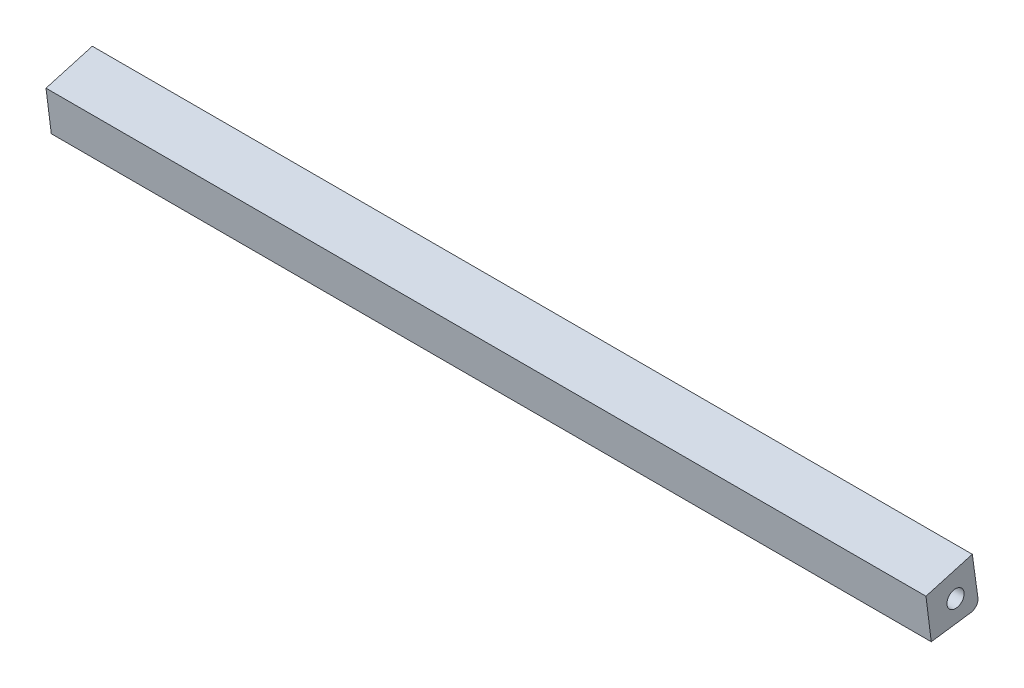
ISO-10303-21;
HEADER;
FILE_DESCRIPTION(('STEP AP214'),'2;1');
FILE_NAME('part.step','',(''),(''),'','','');
FILE_SCHEMA(('AUTOMOTIVE_DESIGN { 1 0 10303 214 1 1 1 1 }'));
ENDSEC;
DATA;
#1=APPLICATION_CONTEXT('core data for automotive mechanical design processes');
#2=APPLICATION_PROTOCOL_DEFINITION('international standard','automotive_design',2000,#1);
#3=PRODUCT_CONTEXT('',#1,'mechanical');
#4=PRODUCT('Part','Part','',(#3));
#5=PRODUCT_RELATED_PRODUCT_CATEGORY('part','',(#4));
#6=PRODUCT_DEFINITION_FORMATION('','',#4);
#7=PRODUCT_DEFINITION_CONTEXT('part definition',#1,'design');
#8=PRODUCT_DEFINITION('design','',#6,#7);
#9=PRODUCT_DEFINITION_SHAPE('','',#8);
#10=(LENGTH_UNIT() NAMED_UNIT(*) SI_UNIT(.MILLI.,.METRE.));
#11=(NAMED_UNIT(*) PLANE_ANGLE_UNIT() SI_UNIT($,.RADIAN.));
#12=(NAMED_UNIT(*) SI_UNIT($,.STERADIAN.) SOLID_ANGLE_UNIT());
#13=UNCERTAINTY_MEASURE_WITH_UNIT(LENGTH_MEASURE(1.E-05),#10,'distance_accuracy_value','');
#14=(GEOMETRIC_REPRESENTATION_CONTEXT(3) GLOBAL_UNCERTAINTY_ASSIGNED_CONTEXT((#13)) GLOBAL_UNIT_ASSIGNED_CONTEXT((#10,
#11,#12)) REPRESENTATION_CONTEXT('',''));
#15=CARTESIAN_POINT('',(0.,0.,0.));
#16=DIRECTION('',(0.,0.,1.));
#17=DIRECTION('',(1.,0.,0.));
#18=AXIS2_PLACEMENT_3D('',#15,#16,#17);
#19=CARTESIAN_POINT('',(215.,14.6744413355915,-105.8501577562));
#20=DIRECTION('',(0.,-0.13732076782963,0.990526631001247));
#21=DIRECTION('',(0.,-0.990526631001247,-0.13732076782963));
#22=AXIS2_PLACEMENT_3D('',#19,#20,#21);
#23=PLANE('',#22);
#24=DIRECTION('',(0.,0.990526631001247,0.13732076782963));
#25=VECTOR('',#24,1.);
#26=CARTESIAN_POINT('',(215.,14.6744413355915,-105.8501577562));
#27=LINE('',#26,#25);
#28=CARTESIAN_POINT('',(215.,65.169668157186,-98.8497974409366));
#29=VERTEX_POINT('',#28);
#30=CARTESIAN_POINT('',(215.,75.0749344671986,-97.4765897626403));
#31=VERTEX_POINT('',#30);
#32=EDGE_CURVE('E81',#29,#31,#27,.T.);
#33=ORIENTED_EDGE('',*,*,#32,.F.);
#34=DIRECTION('',(-1.,0.,0.));
#35=VECTOR('',#34,1.);
#36=CARTESIAN_POINT('',(215.,65.169668157186,-98.8497974409366));
#37=LINE('',#36,#35);
#38=CARTESIAN_POINT('',(0.,65.169668157186,-98.8497974409366));
#39=VERTEX_POINT('',#38);
#40=EDGE_CURVE('E104',#29,#39,#37,.T.);
#41=ORIENTED_EDGE('',*,*,#40,.T.);
#42=DIRECTION('',(0.,0.990526631001247,0.13732076782963));
#43=VECTOR('',#42,1.);
#44=CARTESIAN_POINT('',(0.,14.6744413355915,-105.8501577562));
#45=LINE('',#44,#43);
#46=CARTESIAN_POINT('',(0.,75.0749344671986,-97.4765897626403));
#47=VERTEX_POINT('',#46);
#48=EDGE_CURVE('E102',#39,#47,#45,.T.);
#49=ORIENTED_EDGE('',*,*,#48,.T.);
#50=DIRECTION('',(-1.,0.,0.));
#51=VECTOR('',#50,1.);
#52=CARTESIAN_POINT('',(215.,75.0749344671986,-97.4765897626403));
#53=LINE('',#52,#51);
#54=EDGE_CURVE('E96',#31,#47,#53,.T.);
#55=ORIENTED_EDGE('',*,*,#54,.F.);
#56=EDGE_LOOP('',(#33,#41,#49,#55));
#57=FACE_BOUND('',#56,.T.);
#58=ADVANCED_FACE('F35',(#57),#23,.F.);
#59=CARTESIAN_POINT('',(215.,43.8662739166155,12.4534450859423));
#60=DIRECTION('',(0.,-0.961984714958347,-0.273103292156116));
#61=DIRECTION('',(0.,0.273103292156116,-0.961984714958347));
#62=AXIS2_PLACEMENT_3D('',#59,#60,#61);
#63=PLANE('',#62);
#64=DIRECTION('',(0.,-0.273103292156116,0.961984714958347));
#65=VECTOR('',#64,1.);
#66=CARTESIAN_POINT('',(0.,43.8662739166155,12.4534450859423));
#67=LINE('',#66,#65);
#68=CARTESIAN_POINT('',(0.,71.8610007067405,-86.1557626571146));
#69=VERTEX_POINT('',#68);
#70=EDGE_CURVE('E118',#47,#69,#67,.T.);
#71=ORIENTED_EDGE('',*,*,#70,.T.);
#72=DIRECTION('',(-1.,0.,0.));
#73=VECTOR('',#72,1.);
#74=CARTESIAN_POINT('',(215.,71.8610007067405,-86.1557626571146));
#75=LINE('',#74,#73);
#76=CARTESIAN_POINT('',(215.,71.8610007067405,-86.1557626571146));
#77=VERTEX_POINT('',#76);
#78=EDGE_CURVE('E98',#77,#69,#75,.T.);
#79=ORIENTED_EDGE('',*,*,#78,.F.);
#80=DIRECTION('',(0.,-0.273103292156116,0.961984714958347));
#81=VECTOR('',#80,1.);
#82=CARTESIAN_POINT('',(215.,43.8662739166155,12.4534450859423));
#83=LINE('',#82,#81);
#84=EDGE_CURVE('E84',#31,#77,#83,.T.);
#85=ORIENTED_EDGE('',*,*,#84,.F.);
#86=ORIENTED_EDGE('',*,*,#54,.T.);
#87=EDGE_LOOP('',(#71,#79,#85,#86));
#88=FACE_BOUND('',#87,.T.);
#89=ADVANCED_FACE('F95',(#88),#63,.F.);
#90=CARTESIAN_POINT('',(215.,11.7658973593614,-93.7017559090627));
#91=DIRECTION('',(0.,0.124589152908748,-0.992208417106749));
#92=DIRECTION('',(0.,0.992208417106749,0.124589152908748));
#93=AXIS2_PLACEMENT_3D('',#90,#91,#92);
#94=PLANE('',#93);
#95=DIRECTION('',(0.,-0.992208417106749,-0.124589152908748));
#96=VECTOR('',#95,1.);
#97=CARTESIAN_POINT('',(0.,11.7658973593614,-93.7017559090627));
#98=LINE('',#97,#96);
#99=CARTESIAN_POINT('',(0.,61.5698616637079,-87.4479954922042));
#100=VERTEX_POINT('',#99);
#101=EDGE_CURVE('E116',#69,#100,#98,.T.);
#102=ORIENTED_EDGE('',*,*,#101,.T.);
#103=DIRECTION('',(-1.,0.,0.));
#104=VECTOR('',#103,1.);
#105=CARTESIAN_POINT('',(215.,61.5698616637079,-87.4479954922042));
#106=LINE('',#105,#104);
#107=CARTESIAN_POINT('',(215.,61.5698616637079,-87.4479954922042));
#108=VERTEX_POINT('',#107);
#109=EDGE_CURVE('E107',#108,#100,#106,.T.);
#110=ORIENTED_EDGE('',*,*,#109,.F.);
#111=DIRECTION('',(0.,-0.992208417106749,-0.124589152908748));
#112=VECTOR('',#111,1.);
#113=CARTESIAN_POINT('',(215.,11.7658973593614,-93.7017559090627));
#114=LINE('',#113,#112);
#115=EDGE_CURVE('E100',#77,#108,#114,.T.);
#116=ORIENTED_EDGE('',*,*,#115,.F.);
#117=ORIENTED_EDGE('',*,*,#78,.T.);
#118=EDGE_LOOP('',(#102,#110,#116,#117));
#119=FACE_BOUND('',#118,.T.);
#120=ADVANCED_FACE('F148',(#119),#94,.F.);
#121=CARTESIAN_POINT('',(215.,67.7346295990356,-93.379181481238));
#122=DIRECTION('',(-1.,0.,0.));
#123=DIRECTION('',(0.,0.,1.));
#124=AXIS2_PLACEMENT_3D('',#121,#122,#123);
#125=CYLINDRICAL_SURFACE('',#124,2.1);
#126=CARTESIAN_POINT('',(215.,67.7346295990356,-93.379181481238));
#127=DIRECTION('',(1.,0.,0.));
#128=DIRECTION('',(0.,0.,-1.));
#129=AXIS2_PLACEMENT_3D('',#126,#127,#128);
#130=CIRCLE('',#129,2.1);
#131=CARTESIAN_POINT('',(215.,67.7346295990356,-95.479181481238));
#132=VERTEX_POINT('',#131);
#133=EDGE_CURVE('E91',#132,#132,#130,.T.);
#134=ORIENTED_EDGE('',*,*,#133,.T.);
#135=EDGE_LOOP('',(#134));
#136=FACE_BOUND('',#135,.T.);
#137=CARTESIAN_POINT('',(0.,67.7346295990356,-93.379181481238));
#138=DIRECTION('',(1.,0.,0.));
#139=DIRECTION('',(0.,0.,-1.));
#140=AXIS2_PLACEMENT_3D('',#137,#138,#139);
#141=CIRCLE('',#140,2.1);
#142=CARTESIAN_POINT('',(0.,67.7346295990356,-95.479181481238));
#143=VERTEX_POINT('',#142);
#144=EDGE_CURVE('E121',#143,#143,#141,.T.);
#145=ORIENTED_EDGE('',*,*,#144,.F.);
#146=EDGE_LOOP('',(#145));
#147=FACE_BOUND('',#146,.T.);
#148=ADVANCED_FACE('F129',(#136,#147),#125,.F.);
#149=CARTESIAN_POINT('',(215.,48.5141735595921,6.72571877960414));
#150=DIRECTION('',(0.,0.990526631001247,0.13732076782963));
#151=DIRECTION('',(0.,-0.13732076782963,0.990526631001247));
#152=AXIS2_PLACEMENT_3D('',#149,#150,#151);
#153=PLANE('',#152);
#154=DIRECTION('',(0.,0.13732076782963,-0.990526631001247));
#155=VECTOR('',#154,1.);
#156=CARTESIAN_POINT('',(0.,48.5141735595921,6.72571877960414));
#157=LINE('',#156,#155);
#158=CARTESIAN_POINT('',(0.,62.9139733595243,-97.1433857145934));
#159=VERTEX_POINT('',#158);
#160=EDGE_CURVE('E114',#100,#159,#157,.T.);
#161=ORIENTED_EDGE('',*,*,#160,.T.);
#162=DIRECTION('',(-1.,0.,0.));
#163=VECTOR('',#162,1.);
#164=CARTESIAN_POINT('',(215.,62.9139733595243,-97.1433857145934));
#165=LINE('',#164,#163);
#166=CARTESIAN_POINT('',(215.,62.9139733595243,-97.1433857145934));
#167=VERTEX_POINT('',#166);
#168=EDGE_CURVE('E43',#159,#167,#165,.F.);
#169=ORIENTED_EDGE('',*,*,#168,.T.);
#170=DIRECTION('',(0.,0.13732076782963,-0.990526631001247));
#171=VECTOR('',#170,1.);
#172=CARTESIAN_POINT('',(215.,48.5141735595921,6.72571877960414));
#173=LINE('',#172,#171);
#174=EDGE_CURVE('E113',#108,#167,#173,.T.);
#175=ORIENTED_EDGE('',*,*,#174,.F.);
#176=ORIENTED_EDGE('',*,*,#109,.T.);
#177=EDGE_LOOP('',(#161,#169,#175,#176));
#178=FACE_BOUND('',#177,.T.);
#179=ADVANCED_FACE('F134',(#178),#153,.F.);
#180=CARTESIAN_POINT('',(215.,0.,0.));
#181=DIRECTION('',(1.,0.,0.));
#182=DIRECTION('',(0.,0.,-1.));
#183=AXIS2_PLACEMENT_3D('',#180,#181,#182);
#184=PLANE('',#183);
#185=ORIENTED_EDGE('',*,*,#133,.F.);
#186=EDGE_LOOP('',(#185));
#187=FACE_BOUND('',#186,.T.);
#188=ORIENTED_EDGE('',*,*,#174,.T.);
#189=CARTESIAN_POINT('',(215.,64.8950266215268,-96.8687441789341));
#190=DIRECTION('',(1.,0.,0.));
#191=DIRECTION('',(0.,0.,-1.));
#192=AXIS2_PLACEMENT_3D('',#189,#190,#191);
#193=CIRCLE('',#192,2.);
#194=EDGE_CURVE('E11',#167,#29,#193,.T.);
#195=ORIENTED_EDGE('',*,*,#194,.T.);
#196=ORIENTED_EDGE('',*,*,#32,.T.);
#197=ORIENTED_EDGE('',*,*,#84,.T.);
#198=ORIENTED_EDGE('',*,*,#115,.T.);
#199=EDGE_LOOP('',(#188,#195,#196,#197,#198));
#200=FACE_BOUND('',#199,.T.);
#201=ADVANCED_FACE('F83',(#187,#200),#184,.T.);
#202=CARTESIAN_POINT('',(0.,0.,0.));
#203=DIRECTION('',(1.,0.,0.));
#204=DIRECTION('',(0.,0.,-1.));
#205=AXIS2_PLACEMENT_3D('',#202,#203,#204);
#206=PLANE('',#205);
#207=ORIENTED_EDGE('',*,*,#144,.T.);
#208=EDGE_LOOP('',(#207));
#209=FACE_BOUND('',#208,.T.);
#210=ORIENTED_EDGE('',*,*,#48,.F.);
#211=CARTESIAN_POINT('',(0.,64.8950266215268,-96.8687441789341));
#212=DIRECTION('',(1.,0.,0.));
#213=DIRECTION('',(0.,0.,-1.));
#214=AXIS2_PLACEMENT_3D('',#211,#212,#213);
#215=CIRCLE('',#214,2.);
#216=EDGE_CURVE('E57',#39,#159,#215,.F.);
#217=ORIENTED_EDGE('',*,*,#216,.T.);
#218=ORIENTED_EDGE('',*,*,#160,.F.);
#219=ORIENTED_EDGE('',*,*,#101,.F.);
#220=ORIENTED_EDGE('',*,*,#70,.F.);
#221=EDGE_LOOP('',(#210,#217,#218,#219,#220));
#222=FACE_BOUND('',#221,.T.);
#223=ADVANCED_FACE('F133',(#209,#222),#206,.F.);
#224=CARTESIAN_POINT('',(215.,64.8950266215268,-96.8687441789341));
#225=DIRECTION('',(-1.,0.,0.));
#226=DIRECTION('',(0.,0.,1.));
#227=AXIS2_PLACEMENT_3D('',#224,#225,#226);
#228=CYLINDRICAL_SURFACE('',#227,2.);
#229=ORIENTED_EDGE('',*,*,#194,.F.);
#230=ORIENTED_EDGE('',*,*,#168,.F.);
#231=ORIENTED_EDGE('',*,*,#216,.F.);
#232=ORIENTED_EDGE('',*,*,#40,.F.);
#233=EDGE_LOOP('',(#229,#230,#231,#232));
#234=FACE_BOUND('',#233,.T.);
#235=ADVANCED_FACE('F37',(#234),#228,.T.);
#236=CLOSED_SHELL('',(#58,#89,#120,#148,#179,#201,#223,#235));
#237=MANIFOLD_SOLID_BREP('B2',#236);
#238=ADVANCED_BREP_SHAPE_REPRESENTATION('',(#18,#237),#14);
#239=SHAPE_DEFINITION_REPRESENTATION(#9,#238);
ENDSEC;
END-ISO-10303-21;
